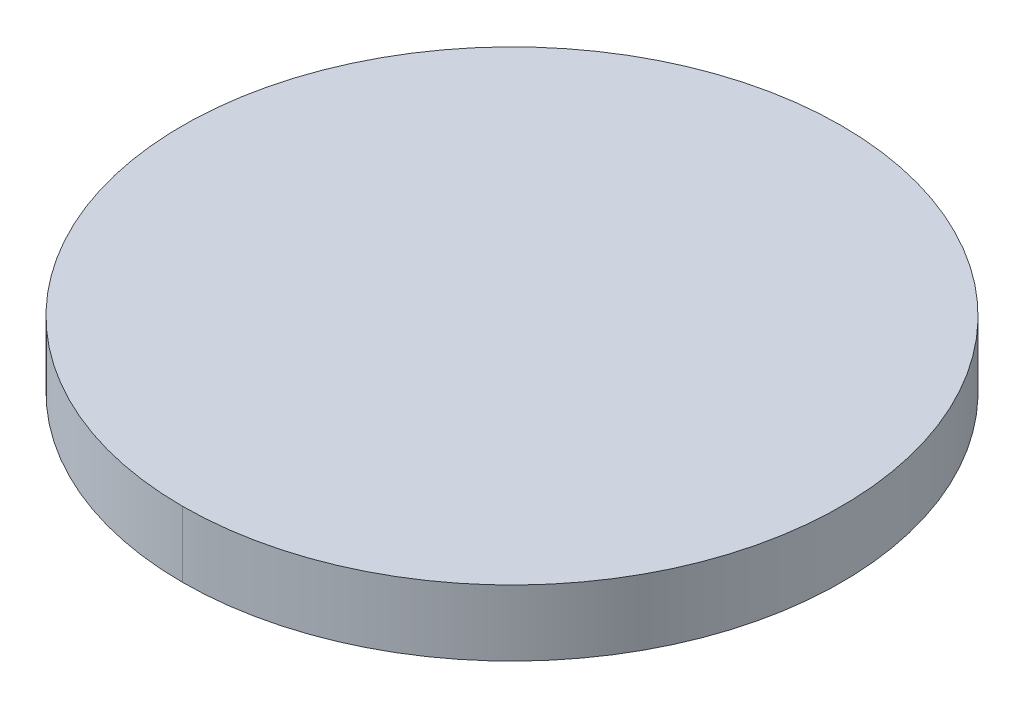
ISO-10303-21;
HEADER;
FILE_DESCRIPTION(('STEP AP214'),'2;1');
FILE_NAME('part.step','',(''),(''),'','','');
FILE_SCHEMA(('AUTOMOTIVE_DESIGN { 1 0 10303 214 1 1 1 1 }'));
ENDSEC;
DATA;
#1=APPLICATION_CONTEXT('core data for automotive mechanical design processes');
#2=APPLICATION_PROTOCOL_DEFINITION('international standard','automotive_design',2000,#1);
#3=PRODUCT_CONTEXT('',#1,'mechanical');
#4=PRODUCT('Part','Part','',(#3));
#5=PRODUCT_RELATED_PRODUCT_CATEGORY('part','',(#4));
#6=PRODUCT_DEFINITION_FORMATION('','',#4);
#7=PRODUCT_DEFINITION_CONTEXT('part definition',#1,'design');
#8=PRODUCT_DEFINITION('design','',#6,#7);
#9=PRODUCT_DEFINITION_SHAPE('','',#8);
#10=(LENGTH_UNIT() NAMED_UNIT(*) SI_UNIT(.MILLI.,.METRE.));
#11=(NAMED_UNIT(*) PLANE_ANGLE_UNIT() SI_UNIT($,.RADIAN.));
#12=(NAMED_UNIT(*) SI_UNIT($,.STERADIAN.) SOLID_ANGLE_UNIT());
#13=UNCERTAINTY_MEASURE_WITH_UNIT(LENGTH_MEASURE(1.E-05),#10,'distance_accuracy_value','');
#14=(GEOMETRIC_REPRESENTATION_CONTEXT(3) GLOBAL_UNCERTAINTY_ASSIGNED_CONTEXT((#13)) GLOBAL_UNIT_ASSIGNED_CONTEXT((#10,
#11,#12)) REPRESENTATION_CONTEXT('',''));
#15=CARTESIAN_POINT('',(0.,0.,0.));
#16=DIRECTION('',(0.,0.,1.));
#17=DIRECTION('',(1.,0.,0.));
#18=AXIS2_PLACEMENT_3D('',#15,#16,#17);
#19=CARTESIAN_POINT('',(0.,0.1,0.));
#20=DIRECTION('',(0.,1.,0.));
#21=DIRECTION('',(1.,0.,0.));
#22=AXIS2_PLACEMENT_3D('',#19,#20,#21);
#23=PLANE('',#22);
#24=CARTESIAN_POINT('',(0.,0.1,0.));
#25=DIRECTION('',(0.,-1.,0.));
#26=DIRECTION('',(0.,0.,1.));
#27=AXIS2_PLACEMENT_3D('',#24,#25,#26);
#28=CIRCLE('',#27,0.5);
#29=CARTESIAN_POINT('',(0.,0.1,0.5));
#30=VERTEX_POINT('',#29);
#31=CARTESIAN_POINT('',(0.,0.1,-0.5));
#32=VERTEX_POINT('',#31);
#33=EDGE_CURVE('E11',#30,#32,#28,.T.);
#34=ORIENTED_EDGE('',*,*,#33,.F.);
#35=CARTESIAN_POINT('',(0.,0.1,0.));
#36=DIRECTION('',(0.,-1.,0.));
#37=DIRECTION('',(0.,0.,1.));
#38=AXIS2_PLACEMENT_3D('',#35,#36,#37);
#39=CIRCLE('',#38,0.5);
#40=EDGE_CURVE('E65',#32,#30,#39,.T.);
#41=ORIENTED_EDGE('',*,*,#40,.F.);
#42=EDGE_LOOP('',(#34,#41));
#43=FACE_BOUND('',#42,.T.);
#44=ADVANCED_FACE('F17',(#43),#23,.T.);
#45=CARTESIAN_POINT('',(0.,0.,0.));
#46=DIRECTION('',(0.,1.,0.));
#47=DIRECTION('',(0.,0.,1.));
#48=AXIS2_PLACEMENT_3D('',#45,#46,#47);
#49=CYLINDRICAL_SURFACE('',#48,0.5);
#50=DIRECTION('',(0.,1.,0.));
#51=VECTOR('',#50,1.);
#52=CARTESIAN_POINT('',(0.,0.,-0.5));
#53=LINE('',#52,#51);
#54=CARTESIAN_POINT('',(0.,0.,-0.5));
#55=VERTEX_POINT('',#54);
#56=EDGE_CURVE('E57',#55,#32,#53,.T.);
#57=ORIENTED_EDGE('',*,*,#56,.F.);
#58=CARTESIAN_POINT('',(0.,0.,0.));
#59=DIRECTION('',(0.,1.,0.));
#60=DIRECTION('',(0.,0.,1.));
#61=AXIS2_PLACEMENT_3D('',#58,#59,#60);
#62=CIRCLE('',#61,0.5);
#63=CARTESIAN_POINT('',(0.,0.,0.5));
#64=VERTEX_POINT('',#63);
#65=EDGE_CURVE('E25',#55,#64,#62,.T.);
#66=ORIENTED_EDGE('',*,*,#65,.T.);
#67=DIRECTION('',(0.,1.,0.));
#68=VECTOR('',#67,1.);
#69=CARTESIAN_POINT('',(0.,0.,0.5));
#70=LINE('',#69,#68);
#71=EDGE_CURVE('E54',#64,#30,#70,.T.);
#72=ORIENTED_EDGE('',*,*,#71,.T.);
#73=ORIENTED_EDGE('',*,*,#33,.T.);
#74=EDGE_LOOP('',(#57,#66,#72,#73));
#75=FACE_BOUND('',#74,.T.);
#76=ADVANCED_FACE('F53',(#75),#49,.T.);
#77=CARTESIAN_POINT('',(0.,0.,0.));
#78=DIRECTION('',(0.,1.,0.));
#79=DIRECTION('',(1.,0.,0.));
#80=AXIS2_PLACEMENT_3D('',#77,#78,#79);
#81=PLANE('',#80);
#82=CARTESIAN_POINT('',(0.,0.,0.));
#83=DIRECTION('',(0.,1.,0.));
#84=DIRECTION('',(0.,0.,1.));
#85=AXIS2_PLACEMENT_3D('',#82,#83,#84);
#86=CIRCLE('',#85,0.5);
#87=EDGE_CURVE('E64',#64,#55,#86,.T.);
#88=ORIENTED_EDGE('',*,*,#87,.F.);
#89=ORIENTED_EDGE('',*,*,#65,.F.);
#90=EDGE_LOOP('',(#88,#89));
#91=FACE_BOUND('',#90,.T.);
#92=ADVANCED_FACE('F68',(#91),#81,.F.);
#93=CARTESIAN_POINT('',(0.,0.,0.));
#94=DIRECTION('',(0.,1.,0.));
#95=DIRECTION('',(0.,0.,1.));
#96=AXIS2_PLACEMENT_3D('',#93,#94,#95);
#97=CYLINDRICAL_SURFACE('',#96,0.5);
#98=ORIENTED_EDGE('',*,*,#87,.T.);
#99=ORIENTED_EDGE('',*,*,#56,.T.);
#100=ORIENTED_EDGE('',*,*,#40,.T.);
#101=ORIENTED_EDGE('',*,*,#71,.F.);
#102=EDGE_LOOP('',(#98,#99,#100,#101));
#103=FACE_BOUND('',#102,.T.);
#104=ADVANCED_FACE('F63',(#103),#97,.T.);
#105=CLOSED_SHELL('',(#44,#76,#92,#104));
#106=MANIFOLD_SOLID_BREP('B1',#105);
#107=ADVANCED_BREP_SHAPE_REPRESENTATION('',(#18,#106),#14);
#108=SHAPE_DEFINITION_REPRESENTATION(#9,#107);
ENDSEC;
END-ISO-10303-21;
